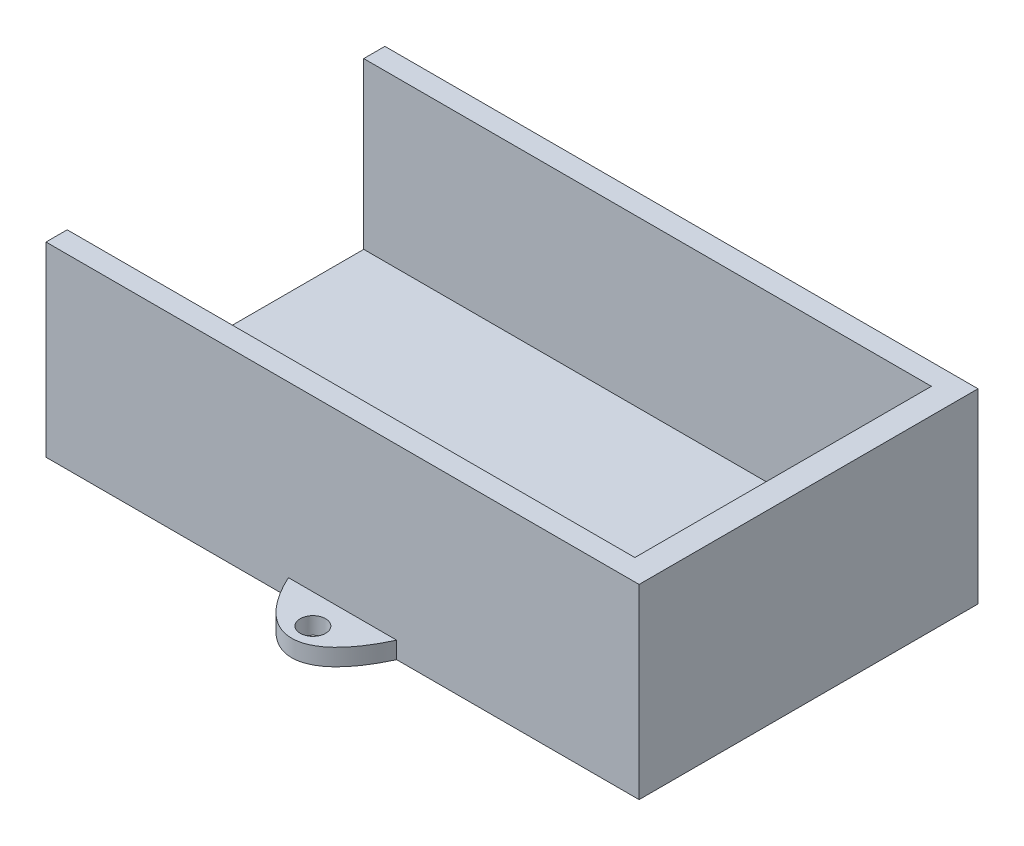
ISO-10303-21;
HEADER;
FILE_DESCRIPTION(('STEP AP214'),'2;1');
FILE_NAME('part.step','',(''),(''),'','','');
FILE_SCHEMA(('AUTOMOTIVE_DESIGN { 1 0 10303 214 1 1 1 1 }'));
ENDSEC;
DATA;
#1=APPLICATION_CONTEXT('core data for automotive mechanical design processes');
#2=APPLICATION_PROTOCOL_DEFINITION('international standard','automotive_design',2000,#1);
#3=PRODUCT_CONTEXT('',#1,'mechanical');
#4=PRODUCT('Part','Part','',(#3));
#5=PRODUCT_RELATED_PRODUCT_CATEGORY('part','',(#4));
#6=PRODUCT_DEFINITION_FORMATION('','',#4);
#7=PRODUCT_DEFINITION_CONTEXT('part definition',#1,'design');
#8=PRODUCT_DEFINITION('design','',#6,#7);
#9=PRODUCT_DEFINITION_SHAPE('','',#8);
#10=(LENGTH_UNIT() NAMED_UNIT(*) SI_UNIT(.MILLI.,.METRE.));
#11=(NAMED_UNIT(*) PLANE_ANGLE_UNIT() SI_UNIT($,.RADIAN.));
#12=(NAMED_UNIT(*) SI_UNIT($,.STERADIAN.) SOLID_ANGLE_UNIT());
#13=UNCERTAINTY_MEASURE_WITH_UNIT(LENGTH_MEASURE(1.E-05),#10,'distance_accuracy_value','');
#14=(GEOMETRIC_REPRESENTATION_CONTEXT(3) GLOBAL_UNCERTAINTY_ASSIGNED_CONTEXT((#13)) GLOBAL_UNIT_ASSIGNED_CONTEXT((#10,
#11,#12)) REPRESENTATION_CONTEXT('',''));
#15=CARTESIAN_POINT('',(0.,0.,0.));
#16=DIRECTION('',(0.,0.,1.));
#17=DIRECTION('',(1.,0.,0.));
#18=AXIS2_PLACEMENT_3D('',#15,#16,#17);
#19=CARTESIAN_POINT('',(32.767368911884,25.,-26.9815975216378));
#20=DIRECTION('',(0.,0.,1.));
#21=DIRECTION('',(1.,0.,0.));
#22=AXIS2_PLACEMENT_3D('',#19,#20,#21);
#23=PLANE('',#22);
#24=DIRECTION('',(1.,0.,0.));
#25=VECTOR('',#24,1.);
#26=CARTESIAN_POINT('',(32.767368911884,1.99999999999999,-26.9815975216378));
#27=LINE('',#26,#25);
#28=CARTESIAN_POINT('',(-8.62234175189912,1.99999999999999,-26.9815975216378));
#29=VERTEX_POINT('',#28);
#30=CARTESIAN_POINT('',(4.15707957566717,1.99999999999999,-26.9815975216378));
#31=VERTEX_POINT('',#30);
#32=EDGE_CURVE('E64',#29,#31,#27,.T.);
#33=ORIENTED_EDGE('',*,*,#32,.F.);
#34=DIRECTION('',(0.,-1.,0.));
#35=VECTOR('',#34,1.);
#36=CARTESIAN_POINT('',(-8.62234175189912,2.,-26.9815975216378));
#37=LINE('',#36,#35);
#38=CARTESIAN_POINT('',(-8.62234175189912,0.,-26.9815975216378));
#39=VERTEX_POINT('',#38);
#40=EDGE_CURVE('E155',#29,#39,#37,.T.);
#41=ORIENTED_EDGE('',*,*,#40,.T.);
#42=DIRECTION('',(-1.,0.,0.));
#43=VECTOR('',#42,1.);
#44=CARTESIAN_POINT('',(32.767368911884,0.,-26.9815975216378));
#45=LINE('',#44,#43);
#46=CARTESIAN_POINT('',(-37.232631088116,0.,-26.9815975216378));
#47=VERTEX_POINT('',#46);
#48=EDGE_CURVE('E209',#39,#47,#45,.T.);
#49=ORIENTED_EDGE('',*,*,#48,.T.);
#50=DIRECTION('',(0.,-1.,0.));
#51=VECTOR('',#50,1.);
#52=CARTESIAN_POINT('',(-37.232631088116,25.,-26.9815975216378));
#53=LINE('',#52,#51);
#54=CARTESIAN_POINT('',(-37.232631088116,22.,-26.9815975216378));
#55=VERTEX_POINT('',#54);
#56=EDGE_CURVE('E237',#55,#47,#53,.T.);
#57=ORIENTED_EDGE('',*,*,#56,.F.);
#58=DIRECTION('',(-1.,0.,0.));
#59=VECTOR('',#58,1.);
#60=CARTESIAN_POINT('',(-37.232631088116,22.,-26.9815975216378));
#61=LINE('',#60,#59);
#62=CARTESIAN_POINT('',(32.767368911884,22.,-26.9815975216378));
#63=VERTEX_POINT('',#62);
#64=EDGE_CURVE('E174',#63,#55,#61,.T.);
#65=ORIENTED_EDGE('',*,*,#64,.F.);
#66=DIRECTION('',(0.,-1.,0.));
#67=VECTOR('',#66,1.);
#68=CARTESIAN_POINT('',(32.767368911884,25.,-26.9815975216378));
#69=LINE('',#68,#67);
#70=CARTESIAN_POINT('',(32.767368911884,0.,-26.9815975216378));
#71=VERTEX_POINT('',#70);
#72=EDGE_CURVE('E228',#63,#71,#69,.T.);
#73=ORIENTED_EDGE('',*,*,#72,.T.);
#74=CARTESIAN_POINT('',(4.15707957566717,0.,-26.9815975216378));
#75=VERTEX_POINT('',#74);
#76=EDGE_CURVE('E213',#71,#75,#45,.T.);
#77=ORIENTED_EDGE('',*,*,#76,.T.);
#78=DIRECTION('',(0.,-1.,0.));
#79=VECTOR('',#78,1.);
#80=CARTESIAN_POINT('',(4.15707957566716,2.,-26.9815975216378));
#81=LINE('',#80,#79);
#82=EDGE_CURVE('E60',#75,#31,#81,.F.);
#83=ORIENTED_EDGE('',*,*,#82,.T.);
#84=EDGE_LOOP('',(#33,#41,#49,#57,#65,#73,#77,#83));
#85=FACE_BOUND('',#84,.T.);
#86=ADVANCED_FACE('F45',(#85),#23,.F.);
#87=CARTESIAN_POINT('',(-37.232631088116,25.,13.0184024783622));
#88=DIRECTION('',(-1.,0.,0.));
#89=DIRECTION('',(0.,0.,1.));
#90=AXIS2_PLACEMENT_3D('',#87,#88,#89);
#91=PLANE('',#90);
#92=DIRECTION('',(0.,-1.,0.));
#93=VECTOR('',#92,1.);
#94=CARTESIAN_POINT('',(-37.232631088116,25.,13.0184024783622));
#95=LINE('',#94,#93);
#96=CARTESIAN_POINT('',(-37.232631088116,22.,13.0184024783622));
#97=VERTEX_POINT('',#96);
#98=CARTESIAN_POINT('',(-37.232631088116,0.,13.0184024783622));
#99=VERTEX_POINT('',#98);
#100=EDGE_CURVE('E234',#97,#99,#95,.T.);
#101=ORIENTED_EDGE('',*,*,#100,.F.);
#102=DIRECTION('',(0.,0.,1.));
#103=VECTOR('',#102,1.);
#104=CARTESIAN_POINT('',(-37.232631088116,22.,-26.9815975216378));
#105=LINE('',#104,#103);
#106=CARTESIAN_POINT('',(-37.232631088116,22.,10.5184024783622));
#107=VERTEX_POINT('',#106);
#108=EDGE_CURVE('E164',#107,#97,#105,.T.);
#109=ORIENTED_EDGE('',*,*,#108,.F.);
#110=DIRECTION('',(0.,1.,0.));
#111=VECTOR('',#110,1.);
#112=CARTESIAN_POINT('',(-37.232631088116,2.5,10.5184024783622));
#113=LINE('',#112,#111);
#114=CARTESIAN_POINT('',(-37.232631088116,2.5,10.5184024783622));
#115=VERTEX_POINT('',#114);
#116=EDGE_CURVE('E183',#115,#107,#113,.T.);
#117=ORIENTED_EDGE('',*,*,#116,.F.);
#118=DIRECTION('',(0.,0.,1.));
#119=VECTOR('',#118,1.);
#120=CARTESIAN_POINT('',(-37.232631088116,2.5,-24.4815975216378));
#121=LINE('',#120,#119);
#122=CARTESIAN_POINT('',(-37.232631088116,2.5,-24.4815975216378));
#123=VERTEX_POINT('',#122);
#124=EDGE_CURVE('E189',#123,#115,#121,.T.);
#125=ORIENTED_EDGE('',*,*,#124,.F.);
#126=DIRECTION('',(0.,-1.,0.));
#127=VECTOR('',#126,1.);
#128=CARTESIAN_POINT('',(-37.232631088116,2.5,-24.4815975216378));
#129=LINE('',#128,#127);
#130=CARTESIAN_POINT('',(-37.232631088116,22.,-24.4815975216378));
#131=VERTEX_POINT('',#130);
#132=EDGE_CURVE('E200',#131,#123,#129,.T.);
#133=ORIENTED_EDGE('',*,*,#132,.F.);
#134=EDGE_CURVE('E165',#55,#131,#105,.T.);
#135=ORIENTED_EDGE('',*,*,#134,.F.);
#136=ORIENTED_EDGE('',*,*,#56,.T.);
#137=DIRECTION('',(0.,0.,-1.));
#138=VECTOR('',#137,1.);
#139=CARTESIAN_POINT('',(-37.232631088116,0.,13.0184024783622));
#140=LINE('',#139,#138);
#141=EDGE_CURVE('E216',#99,#47,#140,.T.);
#142=ORIENTED_EDGE('',*,*,#141,.F.);
#143=EDGE_LOOP('',(#101,#109,#117,#125,#133,#135,#136,#142));
#144=FACE_BOUND('',#143,.T.);
#145=ADVANCED_FACE('F262',(#144),#91,.T.);
#146=CARTESIAN_POINT('',(32.767368911884,25.,13.0184024783622));
#147=DIRECTION('',(0.,0.,1.));
#148=DIRECTION('',(1.,0.,0.));
#149=AXIS2_PLACEMENT_3D('',#146,#147,#148);
#150=PLANE('',#149);
#151=DIRECTION('',(0.,-1.,0.));
#152=VECTOR('',#151,1.);
#153=CARTESIAN_POINT('',(-8.62234175189915,2.,13.0184024783622));
#154=LINE('',#153,#152);
#155=CARTESIAN_POINT('',(-8.62234175189915,1.99999999999999,13.0184024783622));
#156=VERTEX_POINT('',#155);
#157=CARTESIAN_POINT('',(-8.62234175189915,0.,13.0184024783622));
#158=VERTEX_POINT('',#157);
#159=EDGE_CURVE('E141',#156,#158,#154,.T.);
#160=ORIENTED_EDGE('',*,*,#159,.F.);
#161=DIRECTION('',(1.,0.,0.));
#162=VECTOR('',#161,1.);
#163=CARTESIAN_POINT('',(32.767368911884,1.99999999999999,13.0184024783622));
#164=LINE('',#163,#162);
#165=CARTESIAN_POINT('',(4.15707957566713,1.99999999999999,13.0184024783622));
#166=VERTEX_POINT('',#165);
#167=EDGE_CURVE('E11',#156,#166,#164,.T.);
#168=ORIENTED_EDGE('',*,*,#167,.T.);
#169=DIRECTION('',(0.,-1.,0.));
#170=VECTOR('',#169,1.);
#171=CARTESIAN_POINT('',(4.15707957566713,2.,13.0184024783622));
#172=LINE('',#171,#170);
#173=CARTESIAN_POINT('',(4.15707957566713,0.,13.0184024783622));
#174=VERTEX_POINT('',#173);
#175=EDGE_CURVE('E143',#174,#166,#172,.F.);
#176=ORIENTED_EDGE('',*,*,#175,.F.);
#177=DIRECTION('',(-1.,0.,0.));
#178=VECTOR('',#177,1.);
#179=CARTESIAN_POINT('',(32.767368911884,0.,13.0184024783622));
#180=LINE('',#179,#178);
#181=CARTESIAN_POINT('',(32.767368911884,0.,13.0184024783622));
#182=VERTEX_POINT('',#181);
#183=EDGE_CURVE('E220',#182,#174,#180,.T.);
#184=ORIENTED_EDGE('',*,*,#183,.F.);
#185=DIRECTION('',(0.,-1.,0.));
#186=VECTOR('',#185,1.);
#187=CARTESIAN_POINT('',(32.767368911884,25.,13.0184024783622));
#188=LINE('',#187,#186);
#189=CARTESIAN_POINT('',(32.767368911884,22.,13.0184024783622));
#190=VERTEX_POINT('',#189);
#191=EDGE_CURVE('E231',#190,#182,#188,.T.);
#192=ORIENTED_EDGE('',*,*,#191,.F.);
#193=DIRECTION('',(1.,0.,0.));
#194=VECTOR('',#193,1.);
#195=CARTESIAN_POINT('',(-37.232631088116,22.,13.0184024783622));
#196=LINE('',#195,#194);
#197=EDGE_CURVE('E168',#97,#190,#196,.T.);
#198=ORIENTED_EDGE('',*,*,#197,.F.);
#199=ORIENTED_EDGE('',*,*,#100,.T.);
#200=EDGE_CURVE('E150',#158,#99,#180,.T.);
#201=ORIENTED_EDGE('',*,*,#200,.F.);
#202=EDGE_LOOP('',(#160,#168,#176,#184,#192,#198,#199,#201));
#203=FACE_BOUND('',#202,.T.);
#204=ADVANCED_FACE('F148',(#203),#150,.T.);
#205=CARTESIAN_POINT('',(32.767368911884,25.,13.0184024783622));
#206=DIRECTION('',(-1.,0.,0.));
#207=DIRECTION('',(0.,0.,1.));
#208=AXIS2_PLACEMENT_3D('',#205,#206,#207);
#209=PLANE('',#208);
#210=DIRECTION('',(0.,0.,-1.));
#211=VECTOR('',#210,1.);
#212=CARTESIAN_POINT('',(32.767368911884,22.,-26.9815975216378));
#213=LINE('',#212,#211);
#214=EDGE_CURVE('E171',#190,#63,#213,.T.);
#215=ORIENTED_EDGE('',*,*,#214,.F.);
#216=ORIENTED_EDGE('',*,*,#191,.T.);
#217=DIRECTION('',(0.,0.,-1.));
#218=VECTOR('',#217,1.);
#219=CARTESIAN_POINT('',(32.767368911884,0.,13.0184024783622));
#220=LINE('',#219,#218);
#221=EDGE_CURVE('E224',#182,#71,#220,.T.);
#222=ORIENTED_EDGE('',*,*,#221,.T.);
#223=ORIENTED_EDGE('',*,*,#72,.F.);
#224=EDGE_LOOP('',(#215,#216,#222,#223));
#225=FACE_BOUND('',#224,.T.);
#226=ADVANCED_FACE('F306',(#225),#209,.F.);
#227=CARTESIAN_POINT('',(29.767368911884,2.5,10.5184024783622));
#228=DIRECTION('',(0.,0.,1.));
#229=DIRECTION('',(1.,0.,0.));
#230=AXIS2_PLACEMENT_3D('',#227,#228,#229);
#231=PLANE('',#230);
#232=DIRECTION('',(-1.,0.,0.));
#233=VECTOR('',#232,1.);
#234=CARTESIAN_POINT('',(29.767368911884,22.,10.5184024783622));
#235=LINE('',#234,#233);
#236=CARTESIAN_POINT('',(29.767368911884,22.,10.5184024783622));
#237=VERTEX_POINT('',#236);
#238=EDGE_CURVE('E180',#237,#107,#235,.T.);
#239=ORIENTED_EDGE('',*,*,#238,.F.);
#240=DIRECTION('',(0.,1.,0.));
#241=VECTOR('',#240,1.);
#242=CARTESIAN_POINT('',(29.767368911884,2.5,10.5184024783622));
#243=LINE('',#242,#241);
#244=CARTESIAN_POINT('',(29.767368911884,2.5,10.5184024783622));
#245=VERTEX_POINT('',#244);
#246=EDGE_CURVE('E184',#245,#237,#243,.T.);
#247=ORIENTED_EDGE('',*,*,#246,.F.);
#248=DIRECTION('',(-1.,0.,0.));
#249=VECTOR('',#248,1.);
#250=CARTESIAN_POINT('',(29.767368911884,2.5,10.5184024783622));
#251=LINE('',#250,#249);
#252=EDGE_CURVE('E206',#245,#115,#251,.T.);
#253=ORIENTED_EDGE('',*,*,#252,.T.);
#254=ORIENTED_EDGE('',*,*,#116,.T.);
#255=EDGE_LOOP('',(#239,#247,#253,#254));
#256=FACE_BOUND('',#255,.T.);
#257=ADVANCED_FACE('F251',(#256),#231,.F.);
#258=CARTESIAN_POINT('',(29.767368911884,2.5,-24.4815975216378));
#259=DIRECTION('',(0.,0.,-1.));
#260=DIRECTION('',(-1.,0.,0.));
#261=AXIS2_PLACEMENT_3D('',#258,#259,#260);
#262=PLANE('',#261);
#263=DIRECTION('',(1.,0.,0.));
#264=VECTOR('',#263,1.);
#265=CARTESIAN_POINT('',(29.767368911884,22.,-24.4815975216378));
#266=LINE('',#265,#264);
#267=CARTESIAN_POINT('',(29.767368911884,22.,-24.4815975216378));
#268=VERTEX_POINT('',#267);
#269=EDGE_CURVE('E177',#131,#268,#266,.T.);
#270=ORIENTED_EDGE('',*,*,#269,.F.);
#271=ORIENTED_EDGE('',*,*,#132,.T.);
#272=DIRECTION('',(-1.,0.,0.));
#273=VECTOR('',#272,1.);
#274=CARTESIAN_POINT('',(29.767368911884,2.5,-24.4815975216378));
#275=LINE('',#274,#273);
#276=CARTESIAN_POINT('',(29.767368911884,2.5,-24.4815975216378));
#277=VERTEX_POINT('',#276);
#278=EDGE_CURVE('E196',#277,#123,#275,.T.);
#279=ORIENTED_EDGE('',*,*,#278,.F.);
#280=DIRECTION('',(0.,-1.,0.));
#281=VECTOR('',#280,1.);
#282=CARTESIAN_POINT('',(29.767368911884,2.5,-24.4815975216378));
#283=LINE('',#282,#281);
#284=EDGE_CURVE('E188',#268,#277,#283,.T.);
#285=ORIENTED_EDGE('',*,*,#284,.F.);
#286=EDGE_LOOP('',(#270,#271,#279,#285));
#287=FACE_BOUND('',#286,.T.);
#288=ADVANCED_FACE('F298',(#287),#262,.F.);
#289=CARTESIAN_POINT('',(29.767368911884,0.,0.));
#290=DIRECTION('',(1.,0.,0.));
#291=DIRECTION('',(0.,0.,-1.));
#292=AXIS2_PLACEMENT_3D('',#289,#290,#291);
#293=PLANE('',#292);
#294=DIRECTION('',(0.,0.,1.));
#295=VECTOR('',#294,1.);
#296=CARTESIAN_POINT('',(29.767368911884,22.,0.));
#297=LINE('',#296,#295);
#298=EDGE_CURVE('E53',#268,#237,#297,.T.);
#299=ORIENTED_EDGE('',*,*,#298,.F.);
#300=ORIENTED_EDGE('',*,*,#284,.T.);
#301=DIRECTION('',(0.,0.,1.));
#302=VECTOR('',#301,1.);
#303=CARTESIAN_POINT('',(29.767368911884,2.5,-24.4815975216378));
#304=LINE('',#303,#302);
#305=EDGE_CURVE('E192',#277,#245,#304,.T.);
#306=ORIENTED_EDGE('',*,*,#305,.T.);
#307=ORIENTED_EDGE('',*,*,#246,.T.);
#308=EDGE_LOOP('',(#299,#300,#306,#307));
#309=FACE_BOUND('',#308,.T.);
#310=ADVANCED_FACE('F253',(#309),#293,.F.);
#311=CARTESIAN_POINT('',(0.,0.,0.));
#312=DIRECTION('',(0.,-1.,0.));
#313=DIRECTION('',(0.,0.,-1.));
#314=AXIS2_PLACEMENT_3D('',#311,#312,#313);
#315=PLANE('',#314);
#316=CARTESIAN_POINT('',(-2.23263108811601,0.,16.5184024783622));
#317=DIRECTION('',(0.,-1.,0.));
#318=DIRECTION('',(0.,0.,-1.));
#319=AXIS2_PLACEMENT_3D('',#316,#317,#318);
#320=CIRCLE('',#319,1.5);
#321=CARTESIAN_POINT('',(-2.23263108811601,0.,15.0184024783622));
#322=VERTEX_POINT('',#321);
#323=EDGE_CURVE('E283',#322,#322,#320,.T.);
#324=ORIENTED_EDGE('',*,*,#323,.F.);
#325=EDGE_LOOP('',(#324));
#326=FACE_BOUND('',#325,.T.);
#327=CARTESIAN_POINT('',(-2.23263108811603,0.,-30.4815975216378));
#328=DIRECTION('',(0.,-1.,0.));
#329=DIRECTION('',(0.,0.,-1.));
#330=AXIS2_PLACEMENT_3D('',#327,#328,#329);
#331=CIRCLE('',#330,1.5);
#332=CARTESIAN_POINT('',(-2.23263108811603,0.,-31.9815975216378));
#333=VERTEX_POINT('',#332);
#334=EDGE_CURVE('E434',#333,#333,#331,.T.);
#335=ORIENTED_EDGE('',*,*,#334,.F.);
#336=EDGE_LOOP('',(#335));
#337=FACE_BOUND('',#336,.T.);
#338=ORIENTED_EDGE('',*,*,#183,.T.);
#339=CARTESIAN_POINT('',(-2.23263108811599,0.,-6.98159752163777));
#340=DIRECTION('',(0.,-1.,0.));
#341=DIRECTION('',(0.,0.,1.));
#342=AXIS2_PLACEMENT_3D('',#339,#340,#341);
#343=ELLIPSE('',#342,26.,10.);
#344=EDGE_CURVE('E270',#174,#158,#343,.T.);
#345=ORIENTED_EDGE('',*,*,#344,.T.);
#346=ORIENTED_EDGE('',*,*,#200,.T.);
#347=ORIENTED_EDGE('',*,*,#141,.T.);
#348=ORIENTED_EDGE('',*,*,#48,.F.);
#349=EDGE_CURVE('E146',#39,#75,#343,.T.);
#350=ORIENTED_EDGE('',*,*,#349,.T.);
#351=ORIENTED_EDGE('',*,*,#76,.F.);
#352=ORIENTED_EDGE('',*,*,#221,.F.);
#353=EDGE_LOOP('',(#338,#345,#346,#347,#348,#350,#351,#352));
#354=FACE_BOUND('',#353,.T.);
#355=ADVANCED_FACE('F269',(#326,#337,#354),#315,.T.);
#356=CARTESIAN_POINT('',(29.767368911884,2.5,-24.4815975216378));
#357=DIRECTION('',(0.,-1.,0.));
#358=DIRECTION('',(0.,0.,-1.));
#359=AXIS2_PLACEMENT_3D('',#356,#357,#358);
#360=PLANE('',#359);
#361=ORIENTED_EDGE('',*,*,#124,.T.);
#362=ORIENTED_EDGE('',*,*,#252,.F.);
#363=ORIENTED_EDGE('',*,*,#305,.F.);
#364=ORIENTED_EDGE('',*,*,#278,.T.);
#365=EDGE_LOOP('',(#361,#362,#363,#364));
#366=FACE_BOUND('',#365,.T.);
#367=ADVANCED_FACE('F257',(#366),#360,.F.);
#368=CARTESIAN_POINT('',(0.,22.,0.));
#369=DIRECTION('',(0.,1.,0.));
#370=DIRECTION('',(0.,0.,1.));
#371=AXIS2_PLACEMENT_3D('',#368,#369,#370);
#372=PLANE('',#371);
#373=ORIENTED_EDGE('',*,*,#238,.T.);
#374=ORIENTED_EDGE('',*,*,#108,.T.);
#375=ORIENTED_EDGE('',*,*,#197,.T.);
#376=ORIENTED_EDGE('',*,*,#214,.T.);
#377=ORIENTED_EDGE('',*,*,#64,.T.);
#378=ORIENTED_EDGE('',*,*,#134,.T.);
#379=ORIENTED_EDGE('',*,*,#269,.T.);
#380=ORIENTED_EDGE('',*,*,#298,.T.);
#381=EDGE_LOOP('',(#373,#374,#375,#376,#377,#378,#379,#380));
#382=FACE_BOUND('',#381,.T.);
#383=ADVANCED_FACE('F244',(#382),#372,.T.);
#384=CARTESIAN_POINT('',(-2.23263108811599,2.,-6.98159752163777));
#385=DIRECTION('',(0.,-1.,0.));
#386=DIRECTION('',(0.,0.,-1.));
#387=AXIS2_PLACEMENT_3D('',#384,#385,#386);
#388=PLANE('',#387);
#389=CARTESIAN_POINT('',(-2.23263108811601,2.,16.5184024783622));
#390=DIRECTION('',(0.,1.,0.));
#391=DIRECTION('',(0.,0.,1.));
#392=AXIS2_PLACEMENT_3D('',#389,#390,#391);
#393=CIRCLE('',#392,1.5);
#394=CARTESIAN_POINT('',(-2.23263108811601,2.,18.0184024783622));
#395=VERTEX_POINT('',#394);
#396=EDGE_CURVE('E432',#395,#395,#393,.T.);
#397=ORIENTED_EDGE('',*,*,#396,.F.);
#398=EDGE_LOOP('',(#397));
#399=FACE_BOUND('',#398,.T.);
#400=ORIENTED_EDGE('',*,*,#167,.F.);
#401=CARTESIAN_POINT('',(-2.23263108811599,2.,-6.98159752163777));
#402=DIRECTION('',(0.,-1.,0.));
#403=DIRECTION('',(0.,0.,1.));
#404=AXIS2_PLACEMENT_3D('',#401,#402,#403);
#405=ELLIPSE('',#404,26.,10.);
#406=EDGE_CURVE('E134',#166,#156,#405,.T.);
#407=ORIENTED_EDGE('',*,*,#406,.F.);
#408=EDGE_LOOP('',(#400,#407));
#409=FACE_BOUND('',#408,.T.);
#410=ADVANCED_FACE('F133',(#399,#409),#388,.F.);
#411=DIRECTION('',(0.,-1.,0.));
#412=VECTOR('',#411,1.);
#413=SURFACE_OF_LINEAR_EXTRUSION('',#405,#412);
#414=ORIENTED_EDGE('',*,*,#406,.T.);
#415=ORIENTED_EDGE('',*,*,#159,.T.);
#416=ORIENTED_EDGE('',*,*,#344,.F.);
#417=ORIENTED_EDGE('',*,*,#175,.T.);
#418=EDGE_LOOP('',(#414,#415,#416,#417));
#419=FACE_BOUND('',#418,.T.);
#420=ADVANCED_FACE('F140',(#419),#413,.T.);
#421=CARTESIAN_POINT('',(-2.23263108811603,2.,-30.4815975216378));
#422=DIRECTION('',(0.,1.,0.));
#423=DIRECTION('',(0.,0.,1.));
#424=AXIS2_PLACEMENT_3D('',#421,#422,#423);
#425=CIRCLE('',#424,1.5);
#426=CARTESIAN_POINT('',(-2.23263108811603,2.,-28.9815975216378));
#427=VERTEX_POINT('',#426);
#428=EDGE_CURVE('E435',#427,#427,#425,.T.);
#429=ORIENTED_EDGE('',*,*,#428,.F.);
#430=EDGE_LOOP('',(#429));
#431=FACE_BOUND('',#430,.T.);
#432=EDGE_CURVE('E145',#29,#31,#405,.T.);
#433=ORIENTED_EDGE('',*,*,#432,.F.);
#434=ORIENTED_EDGE('',*,*,#32,.T.);
#435=EDGE_LOOP('',(#433,#434));
#436=FACE_BOUND('',#435,.T.);
#437=ADVANCED_FACE('F291',(#431,#436),#388,.F.);
#438=ORIENTED_EDGE('',*,*,#40,.F.);
#439=ORIENTED_EDGE('',*,*,#432,.T.);
#440=ORIENTED_EDGE('',*,*,#82,.F.);
#441=ORIENTED_EDGE('',*,*,#349,.F.);
#442=EDGE_LOOP('',(#438,#439,#440,#441));
#443=FACE_BOUND('',#442,.T.);
#444=ADVANCED_FACE('F292',(#443),#413,.T.);
#445=CARTESIAN_POINT('',(-2.23263108811603,-14.,-30.4815975216378));
#446=DIRECTION('',(0.,1.,0.));
#447=DIRECTION('',(0.,0.,1.));
#448=AXIS2_PLACEMENT_3D('',#445,#446,#447);
#449=CYLINDRICAL_SURFACE('',#448,1.5);
#450=ORIENTED_EDGE('',*,*,#334,.T.);
#451=EDGE_LOOP('',(#450));
#452=FACE_BOUND('',#451,.T.);
#453=ORIENTED_EDGE('',*,*,#428,.T.);
#454=EDGE_LOOP('',(#453));
#455=FACE_BOUND('',#454,.T.);
#456=ADVANCED_FACE('F340',(#452,#455),#449,.F.);
#457=CARTESIAN_POINT('',(-2.23263108811601,-14.,16.5184024783622));
#458=DIRECTION('',(0.,1.,0.));
#459=DIRECTION('',(0.,0.,1.));
#460=AXIS2_PLACEMENT_3D('',#457,#458,#459);
#461=CYLINDRICAL_SURFACE('',#460,1.5);
#462=ORIENTED_EDGE('',*,*,#323,.T.);
#463=EDGE_LOOP('',(#462));
#464=FACE_BOUND('',#463,.T.);
#465=ORIENTED_EDGE('',*,*,#396,.T.);
#466=EDGE_LOOP('',(#465));
#467=FACE_BOUND('',#466,.T.);
#468=ADVANCED_FACE('F365',(#464,#467),#461,.F.);
#469=CLOSED_SHELL('',(#86,#145,#204,#226,#257,#288,#310,#355,#367,#383,#410,#420,#437,#444,#456,#468));
#470=MANIFOLD_SOLID_BREP('B2',#469);
#471=ADVANCED_BREP_SHAPE_REPRESENTATION('',(#18,#470),#14);
#472=SHAPE_DEFINITION_REPRESENTATION(#9,#471);
ENDSEC;
END-ISO-10303-21;
